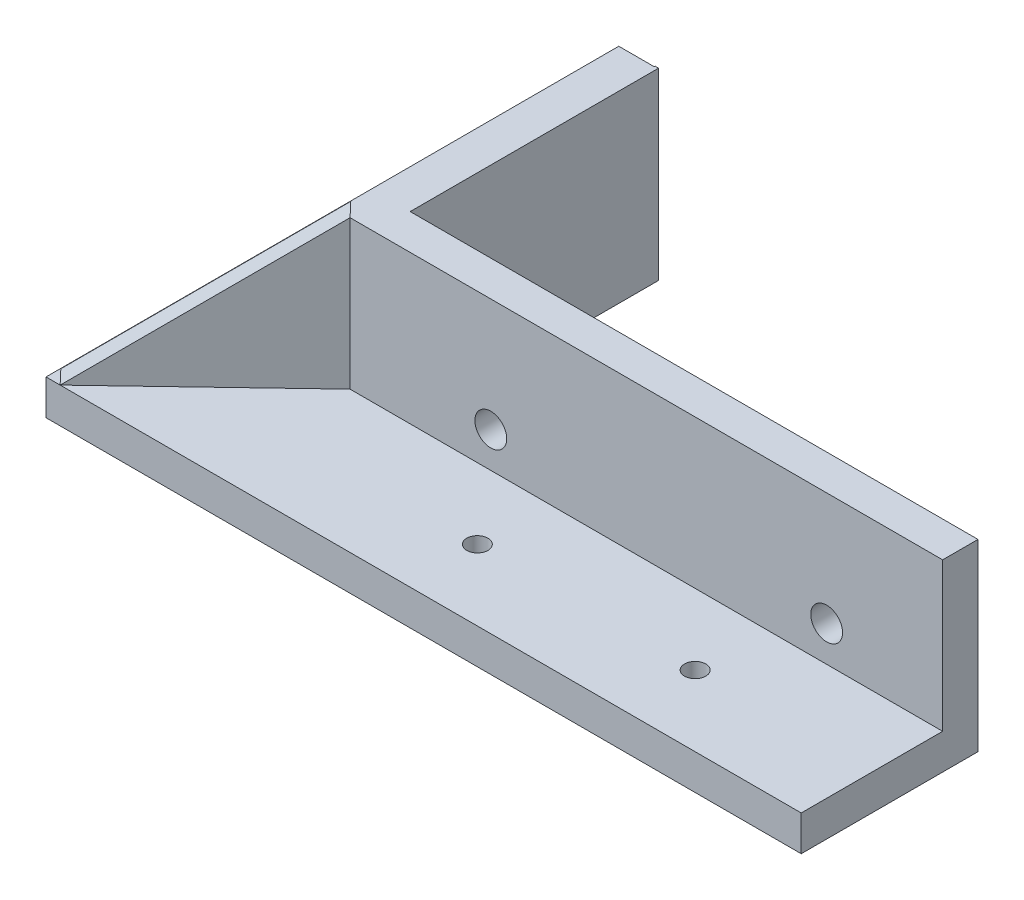
ISO-10303-21;
HEADER;
FILE_DESCRIPTION(('STEP AP214'),'2;1');
FILE_NAME('part.step','',(''),(''),'','','');
FILE_SCHEMA(('AUTOMOTIVE_DESIGN { 1 0 10303 214 1 1 1 1 }'));
ENDSEC;
DATA;
#1=APPLICATION_CONTEXT('core data for automotive mechanical design processes');
#2=APPLICATION_PROTOCOL_DEFINITION('international standard','automotive_design',2000,#1);
#3=PRODUCT_CONTEXT('',#1,'mechanical');
#4=PRODUCT('Part','Part','',(#3));
#5=PRODUCT_RELATED_PRODUCT_CATEGORY('part','',(#4));
#6=PRODUCT_DEFINITION_FORMATION('','',#4);
#7=PRODUCT_DEFINITION_CONTEXT('part definition',#1,'design');
#8=PRODUCT_DEFINITION('design','',#6,#7);
#9=PRODUCT_DEFINITION_SHAPE('','',#8);
#10=(LENGTH_UNIT() NAMED_UNIT(*) SI_UNIT(.MILLI.,.METRE.));
#11=(NAMED_UNIT(*) PLANE_ANGLE_UNIT() SI_UNIT($,.RADIAN.));
#12=(NAMED_UNIT(*) SI_UNIT($,.STERADIAN.) SOLID_ANGLE_UNIT());
#13=UNCERTAINTY_MEASURE_WITH_UNIT(LENGTH_MEASURE(1.E-05),#10,'distance_accuracy_value','');
#14=(GEOMETRIC_REPRESENTATION_CONTEXT(3) GLOBAL_UNCERTAINTY_ASSIGNED_CONTEXT((#13)) GLOBAL_UNIT_ASSIGNED_CONTEXT((#10,
#11,#12)) REPRESENTATION_CONTEXT('',''));
#15=CARTESIAN_POINT('',(0.,0.,0.));
#16=DIRECTION('',(0.,0.,1.));
#17=DIRECTION('',(1.,0.,0.));
#18=AXIS2_PLACEMENT_3D('',#15,#16,#17);
#19=CARTESIAN_POINT('',(0.,5.,-2.49999999999999));
#20=DIRECTION('',(0.,0.,-1.));
#21=DIRECTION('',(-1.,0.,0.));
#22=AXIS2_PLACEMENT_3D('',#19,#20,#21);
#23=PLANE('',#22);
#24=CARTESIAN_POINT('',(-23.5,10.,-2.5));
#25=DIRECTION('',(0.,0.,-1.));
#26=DIRECTION('',(-1.,0.,0.));
#27=AXIS2_PLACEMENT_3D('',#24,#25,#26);
#28=CIRCLE('',#27,2.25);
#29=CARTESIAN_POINT('',(-25.75,10.,-2.5));
#30=VERTEX_POINT('',#29);
#31=EDGE_CURVE('E212',#30,#30,#28,.T.);
#32=ORIENTED_EDGE('',*,*,#31,.F.);
#33=EDGE_LOOP('',(#32));
#34=FACE_BOUND('',#33,.T.);
#35=CARTESIAN_POINT('',(24.,10.,-2.5));
#36=DIRECTION('',(0.,0.,-1.));
#37=DIRECTION('',(-1.,0.,0.));
#38=AXIS2_PLACEMENT_3D('',#35,#36,#37);
#39=CIRCLE('',#38,2.25);
#40=CARTESIAN_POINT('',(21.75,10.,-2.5));
#41=VERTEX_POINT('',#40);
#42=EDGE_CURVE('E207',#41,#41,#39,.T.);
#43=ORIENTED_EDGE('',*,*,#42,.F.);
#44=EDGE_LOOP('',(#43));
#45=FACE_BOUND('',#44,.T.);
#46=DIRECTION('',(1.,0.,0.));
#47=VECTOR('',#46,1.);
#48=CARTESIAN_POINT('',(0.,0.,-2.49999999999999));
#49=LINE('',#48,#47);
#50=CARTESIAN_POINT('',(-39.9,0.,-2.5));
#51=VERTEX_POINT('',#50);
#52=CARTESIAN_POINT('',(40.4,0.,-2.49999999999998));
#53=VERTEX_POINT('',#52);
#54=EDGE_CURVE('E266',#51,#53,#49,.T.);
#55=ORIENTED_EDGE('',*,*,#54,.F.);
#56=DIRECTION('',(0.,1.,0.));
#57=VECTOR('',#56,1.);
#58=CARTESIAN_POINT('',(-39.9,5.,-2.49999999999999));
#59=LINE('',#58,#57);
#60=CARTESIAN_POINT('',(-39.9,26.,-2.5));
#61=VERTEX_POINT('',#60);
#62=EDGE_CURVE('E142',#51,#61,#59,.T.);
#63=ORIENTED_EDGE('',*,*,#62,.T.);
#64=DIRECTION('',(1.,0.,0.));
#65=VECTOR('',#64,1.);
#66=CARTESIAN_POINT('',(0.,26.,-2.49999999999999));
#67=LINE('',#66,#65);
#68=CARTESIAN_POINT('',(40.4,26.,-2.49999999999999));
#69=VERTEX_POINT('',#68);
#70=EDGE_CURVE('E250',#61,#69,#67,.T.);
#71=ORIENTED_EDGE('',*,*,#70,.T.);
#72=DIRECTION('',(0.,-1.,0.));
#73=VECTOR('',#72,1.);
#74=CARTESIAN_POINT('',(40.4,5.,-2.49999999999999));
#75=LINE('',#74,#73);
#76=EDGE_CURVE('E11',#69,#53,#75,.T.);
#77=ORIENTED_EDGE('',*,*,#76,.T.);
#78=EDGE_LOOP('',(#55,#63,#71,#77));
#79=FACE_BOUND('',#78,.T.);
#80=ADVANCED_FACE('F37',(#34,#45,#79),#23,.T.);
#81=CARTESIAN_POINT('',(0.,5.,22.5));
#82=DIRECTION('',(0.,0.,-1.));
#83=DIRECTION('',(-1.,0.,0.));
#84=AXIS2_PLACEMENT_3D('',#81,#82,#83);
#85=PLANE('',#84);
#86=DIRECTION('',(1.,0.,0.));
#87=VECTOR('',#86,1.);
#88=CARTESIAN_POINT('',(0.,0.,22.5));
#89=LINE('',#88,#87);
#90=CARTESIAN_POINT('',(-66.4,0.,22.5));
#91=VERTEX_POINT('',#90);
#92=CARTESIAN_POINT('',(40.4,0.,22.5));
#93=VERTEX_POINT('',#92);
#94=EDGE_CURVE('E254',#91,#93,#89,.T.);
#95=ORIENTED_EDGE('',*,*,#94,.T.);
#96=DIRECTION('',(0.,1.,0.));
#97=VECTOR('',#96,1.);
#98=CARTESIAN_POINT('',(40.4,5.,22.5));
#99=LINE('',#98,#97);
#100=CARTESIAN_POINT('',(40.4,5.,22.5));
#101=VERTEX_POINT('',#100);
#102=EDGE_CURVE('E52',#93,#101,#99,.T.);
#103=ORIENTED_EDGE('',*,*,#102,.T.);
#104=DIRECTION('',(1.,0.,0.));
#105=VECTOR('',#104,1.);
#106=CARTESIAN_POINT('',(0.,5.,22.5));
#107=LINE('',#106,#105);
#108=CARTESIAN_POINT('',(-64.4,5.,22.5));
#109=VERTEX_POINT('',#108);
#110=EDGE_CURVE('E255',#109,#101,#107,.T.);
#111=ORIENTED_EDGE('',*,*,#110,.F.);
#112=DIRECTION('',(-1.,0.,0.));
#113=VECTOR('',#112,1.);
#114=CARTESIAN_POINT('',(0.,5.,22.5));
#115=LINE('',#114,#113);
#116=CARTESIAN_POINT('',(-66.4,5.,22.5));
#117=VERTEX_POINT('',#116);
#118=EDGE_CURVE('E189',#109,#117,#115,.T.);
#119=ORIENTED_EDGE('',*,*,#118,.T.);
#120=DIRECTION('',(0.,-1.,0.));
#121=VECTOR('',#120,1.);
#122=CARTESIAN_POINT('',(-66.4,5.,22.5));
#123=LINE('',#122,#121);
#124=EDGE_CURVE('E233',#117,#91,#123,.T.);
#125=ORIENTED_EDGE('',*,*,#124,.T.);
#126=EDGE_LOOP('',(#95,#103,#111,#119,#125));
#127=FACE_BOUND('',#126,.T.);
#128=ADVANCED_FACE('F39',(#127),#85,.F.);
#129=CARTESIAN_POINT('',(0.,26.,0.));
#130=DIRECTION('',(0.,1.,0.));
#131=DIRECTION('',(0.,0.,1.));
#132=AXIS2_PLACEMENT_3D('',#129,#130,#131);
#133=PLANE('',#132);
#134=ORIENTED_EDGE('',*,*,#70,.F.);
#135=DIRECTION('',(0.,0.,1.));
#136=VECTOR('',#135,1.);
#137=CARTESIAN_POINT('',(-39.9,26.,-37.6291713866203));
#138=LINE('',#137,#136);
#139=CARTESIAN_POINT('',(-39.9,26.,-37.6291713866203));
#140=VERTEX_POINT('',#139);
#141=EDGE_CURVE('E155',#140,#61,#138,.T.);
#142=ORIENTED_EDGE('',*,*,#141,.F.);
#143=DIRECTION('',(-1.,0.,0.));
#144=VECTOR('',#143,1.);
#145=CARTESIAN_POINT('',(-39.9,26.,-37.6291713866203));
#146=LINE('',#145,#144);
#147=CARTESIAN_POINT('',(-40.4,26.,-37.6291713866203));
#148=VERTEX_POINT('',#147);
#149=EDGE_CURVE('E153',#140,#148,#146,.T.);
#150=ORIENTED_EDGE('',*,*,#149,.T.);
#151=DIRECTION('',(0.,0.,1.));
#152=VECTOR('',#151,1.);
#153=CARTESIAN_POINT('',(-40.4,26.,-37.6291713866203));
#154=LINE('',#153,#152);
#155=CARTESIAN_POINT('',(-40.4,26.,-37.5));
#156=VERTEX_POINT('',#155);
#157=EDGE_CURVE('E146',#148,#156,#154,.T.);
#158=ORIENTED_EDGE('',*,*,#157,.T.);
#159=DIRECTION('',(-1.,0.,0.));
#160=VECTOR('',#159,1.);
#161=CARTESIAN_POINT('',(0.,26.,-37.5));
#162=LINE('',#161,#160);
#163=CARTESIAN_POINT('',(-45.4,26.,-37.5));
#164=VERTEX_POINT('',#163);
#165=EDGE_CURVE('E215',#156,#164,#162,.T.);
#166=ORIENTED_EDGE('',*,*,#165,.T.);
#167=DIRECTION('',(0.,0.,1.));
#168=VECTOR('',#167,1.);
#169=CARTESIAN_POINT('',(-45.4,26.,0.));
#170=LINE('',#169,#168);
#171=CARTESIAN_POINT('',(-45.4,26.,0.400000000000003));
#172=VERTEX_POINT('',#171);
#173=EDGE_CURVE('E217',#164,#172,#170,.T.);
#174=ORIENTED_EDGE('',*,*,#173,.T.);
#175=DIRECTION('',(-0.689655172413793,0.,-0.724137931034483));
#176=VECTOR('',#175,1.);
#177=CARTESIAN_POINT('',(-24.0064209274673,26.,22.8632580261593));
#178=LINE('',#177,#176);
#179=CARTESIAN_POINT('',(-43.4,26.,2.50000000000001));
#180=VERTEX_POINT('',#179);
#181=EDGE_CURVE('E187',#180,#172,#178,.T.);
#182=ORIENTED_EDGE('',*,*,#181,.F.);
#183=DIRECTION('',(1.,0.,0.));
#184=VECTOR('',#183,1.);
#185=CARTESIAN_POINT('',(0.,26.,2.5));
#186=LINE('',#185,#184);
#187=CARTESIAN_POINT('',(40.4,26.,2.50000000000001));
#188=VERTEX_POINT('',#187);
#189=EDGE_CURVE('E247',#180,#188,#186,.T.);
#190=ORIENTED_EDGE('',*,*,#189,.T.);
#191=DIRECTION('',(0.,0.,1.));
#192=VECTOR('',#191,1.);
#193=CARTESIAN_POINT('',(40.4,26.,0.));
#194=LINE('',#193,#192);
#195=EDGE_CURVE('E169',#69,#188,#194,.T.);
#196=ORIENTED_EDGE('',*,*,#195,.F.);
#197=EDGE_LOOP('',(#134,#142,#150,#158,#166,#174,#182,#190,#196));
#198=FACE_BOUND('',#197,.T.);
#199=ADVANCED_FACE('F294',(#198),#133,.T.);
#200=CARTESIAN_POINT('',(0.,5.,0.));
#201=DIRECTION('',(0.,1.,0.));
#202=DIRECTION('',(0.,0.,1.));
#203=AXIS2_PLACEMENT_3D('',#200,#201,#202);
#204=PLANE('',#203);
#205=DIRECTION('',(0.,0.,1.));
#206=VECTOR('',#205,1.);
#207=CARTESIAN_POINT('',(-66.4,5.,0.));
#208=LINE('',#207,#206);
#209=CARTESIAN_POINT('',(-66.4,5.,-37.5));
#210=VERTEX_POINT('',#209);
#211=EDGE_CURVE('E227',#210,#117,#208,.T.);
#212=ORIENTED_EDGE('',*,*,#211,.T.);
#213=ORIENTED_EDGE('',*,*,#118,.F.);
#214=DIRECTION('',(0.689655172413793,0.,0.724137931034483));
#215=VECTOR('',#214,1.);
#216=CARTESIAN_POINT('',(-78.8827586206896,5.,7.29310344827587));
#217=LINE('',#216,#215);
#218=CARTESIAN_POINT('',(-66.3500594530321,4.99999999999999,20.4524375743163));
#219=VERTEX_POINT('',#218);
#220=EDGE_CURVE('E179',#219,#109,#217,.T.);
#221=ORIENTED_EDGE('',*,*,#220,.F.);
#222=DIRECTION('',(-0.724137931034483,0.,0.689655172413793));
#223=VECTOR('',#222,1.);
#224=CARTESIAN_POINT('',(-66.4,5.,20.5));
#225=LINE('',#224,#223);
#226=CARTESIAN_POINT('',(-45.4,5.,0.500000000000007));
#227=VERTEX_POINT('',#226);
#228=EDGE_CURVE('E192',#227,#219,#225,.T.);
#229=ORIENTED_EDGE('',*,*,#228,.F.);
#230=DIRECTION('',(0.,0.,-1.));
#231=VECTOR('',#230,1.);
#232=CARTESIAN_POINT('',(-45.4,5.,0.));
#233=LINE('',#232,#231);
#234=CARTESIAN_POINT('',(-45.4,5.,-37.5));
#235=VERTEX_POINT('',#234);
#236=EDGE_CURVE('E60',#227,#235,#233,.T.);
#237=ORIENTED_EDGE('',*,*,#236,.T.);
#238=DIRECTION('',(-1.,0.,0.));
#239=VECTOR('',#238,1.);
#240=CARTESIAN_POINT('',(0.,5.,-37.5));
#241=LINE('',#240,#239);
#242=EDGE_CURVE('E225',#235,#210,#241,.T.);
#243=ORIENTED_EDGE('',*,*,#242,.T.);
#244=EDGE_LOOP('',(#212,#213,#221,#229,#237,#243));
#245=FACE_BOUND('',#244,.T.);
#246=CARTESIAN_POINT('',(-55.4,5.,-12.5));
#247=DIRECTION('',(0.,1.,0.));
#248=DIRECTION('',(0.,0.,1.));
#249=AXIS2_PLACEMENT_3D('',#246,#247,#248);
#250=CIRCLE('',#249,1.5);
#251=CARTESIAN_POINT('',(-55.4,5.,-11.));
#252=VERTEX_POINT('',#251);
#253=EDGE_CURVE('E230',#252,#252,#250,.T.);
#254=ORIENTED_EDGE('',*,*,#253,.F.);
#255=EDGE_LOOP('',(#254));
#256=FACE_BOUND('',#255,.T.);
#257=ADVANCED_FACE('F315',(#245,#256),#204,.T.);
#258=DIRECTION('',(0.,0.,1.));
#259=VECTOR('',#258,1.);
#260=CARTESIAN_POINT('',(40.4,5.,0.));
#261=LINE('',#260,#259);
#262=CARTESIAN_POINT('',(40.4,5.,2.49999999999999));
#263=VERTEX_POINT('',#262);
#264=EDGE_CURVE('E174',#263,#101,#261,.T.);
#265=ORIENTED_EDGE('',*,*,#264,.F.);
#266=DIRECTION('',(-1.,0.,0.));
#267=VECTOR('',#266,1.);
#268=CARTESIAN_POINT('',(0.,5.,2.5));
#269=LINE('',#268,#267);
#270=CARTESIAN_POINT('',(-43.4,5.,2.50000000000001));
#271=VERTEX_POINT('',#270);
#272=EDGE_CURVE('E252',#263,#271,#269,.T.);
#273=ORIENTED_EDGE('',*,*,#272,.T.);
#274=DIRECTION('',(0.724137931034483,0.,-0.689655172413793));
#275=VECTOR('',#274,1.);
#276=CARTESIAN_POINT('',(-43.4,5.,2.50000000000001));
#277=LINE('',#276,#275);
#278=EDGE_CURVE('E195',#109,#271,#277,.T.);
#279=ORIENTED_EDGE('',*,*,#278,.F.);
#280=ORIENTED_EDGE('',*,*,#110,.T.);
#281=EDGE_LOOP('',(#265,#273,#279,#280));
#282=FACE_BOUND('',#281,.T.);
#283=CARTESIAN_POINT('',(15.4,5.,12.5));
#284=DIRECTION('',(0.,1.,0.));
#285=DIRECTION('',(0.,0.,1.));
#286=AXIS2_PLACEMENT_3D('',#283,#284,#285);
#287=CIRCLE('',#286,1.5);
#288=CARTESIAN_POINT('',(15.4,5.,14.));
#289=VERTEX_POINT('',#288);
#290=EDGE_CURVE('E45',#289,#289,#287,.F.);
#291=ORIENTED_EDGE('',*,*,#290,.T.);
#292=EDGE_LOOP('',(#291));
#293=FACE_BOUND('',#292,.T.);
#294=CARTESIAN_POINT('',(-15.4,5.,12.5));
#295=DIRECTION('',(0.,1.,0.));
#296=DIRECTION('',(0.,0.,1.));
#297=AXIS2_PLACEMENT_3D('',#294,#295,#296);
#298=CIRCLE('',#297,1.5);
#299=CARTESIAN_POINT('',(-15.4,5.,14.));
#300=VERTEX_POINT('',#299);
#301=EDGE_CURVE('E258',#300,#300,#298,.T.);
#302=ORIENTED_EDGE('',*,*,#301,.F.);
#303=EDGE_LOOP('',(#302));
#304=FACE_BOUND('',#303,.T.);
#305=ADVANCED_FACE('F313',(#282,#293,#304),#204,.T.);
#306=CARTESIAN_POINT('',(0.,26.,2.5));
#307=DIRECTION('',(0.,0.,-1.));
#308=DIRECTION('',(-1.,0.,0.));
#309=AXIS2_PLACEMENT_3D('',#306,#307,#308);
#310=PLANE('',#309);
#311=CARTESIAN_POINT('',(24.,10.,2.5));
#312=DIRECTION('',(0.,0.,1.));
#313=DIRECTION('',(1.,0.,0.));
#314=AXIS2_PLACEMENT_3D('',#311,#312,#313);
#315=CIRCLE('',#314,2.25);
#316=CARTESIAN_POINT('',(26.25,10.,2.5));
#317=VERTEX_POINT('',#316);
#318=EDGE_CURVE('E203',#317,#317,#315,.T.);
#319=ORIENTED_EDGE('',*,*,#318,.F.);
#320=EDGE_LOOP('',(#319));
#321=FACE_BOUND('',#320,.T.);
#322=CARTESIAN_POINT('',(-23.5,10.,2.5));
#323=DIRECTION('',(0.,0.,1.));
#324=DIRECTION('',(1.,0.,0.));
#325=AXIS2_PLACEMENT_3D('',#322,#323,#324);
#326=CIRCLE('',#325,2.25);
#327=CARTESIAN_POINT('',(-21.25,10.,2.5));
#328=VERTEX_POINT('',#327);
#329=EDGE_CURVE('E204',#328,#328,#326,.T.);
#330=ORIENTED_EDGE('',*,*,#329,.F.);
#331=EDGE_LOOP('',(#330));
#332=FACE_BOUND('',#331,.T.);
#333=ORIENTED_EDGE('',*,*,#272,.F.);
#334=DIRECTION('',(0.,1.,0.));
#335=VECTOR('',#334,1.);
#336=CARTESIAN_POINT('',(40.4,26.,2.49999999999999));
#337=LINE('',#336,#335);
#338=EDGE_CURVE('E171',#263,#188,#337,.T.);
#339=ORIENTED_EDGE('',*,*,#338,.T.);
#340=ORIENTED_EDGE('',*,*,#189,.F.);
#341=DIRECTION('',(0.,-1.,0.));
#342=VECTOR('',#341,1.);
#343=CARTESIAN_POINT('',(-43.4,26.,2.50000000000001));
#344=LINE('',#343,#342);
#345=EDGE_CURVE('E200',#180,#271,#344,.T.);
#346=ORIENTED_EDGE('',*,*,#345,.T.);
#347=EDGE_LOOP('',(#333,#339,#340,#346));
#348=FACE_BOUND('',#347,.T.);
#349=ADVANCED_FACE('F305',(#321,#332,#348),#310,.F.);
#350=CARTESIAN_POINT('',(-45.4,26.,0.));
#351=DIRECTION('',(1.,0.,0.));
#352=DIRECTION('',(0.,0.,-1.));
#353=AXIS2_PLACEMENT_3D('',#350,#351,#352);
#354=PLANE('',#353);
#355=DIRECTION('',(0.,-1.,0.));
#356=VECTOR('',#355,1.);
#357=CARTESIAN_POINT('',(-45.4,26.,0.500000000000007));
#358=LINE('',#357,#356);
#359=CARTESIAN_POINT('',(-45.4,25.9500594530321,0.500000000000007));
#360=VERTEX_POINT('',#359);
#361=EDGE_CURVE('E198',#360,#227,#358,.T.);
#362=ORIENTED_EDGE('',*,*,#361,.F.);
#363=DIRECTION('',(0.,0.446788032480034,-0.894639845989781));
#364=VECTOR('',#363,1.);
#365=CARTESIAN_POINT('',(-45.4,26.1598857506272,0.0798478183869536));
#366=LINE('',#365,#364);
#367=EDGE_CURVE('E184',#360,#172,#366,.T.);
#368=ORIENTED_EDGE('',*,*,#367,.T.);
#369=ORIENTED_EDGE('',*,*,#173,.F.);
#370=DIRECTION('',(0.,-1.,0.));
#371=VECTOR('',#370,1.);
#372=CARTESIAN_POINT('',(-45.4,26.,-37.5));
#373=LINE('',#372,#371);
#374=EDGE_CURVE('E220',#164,#235,#373,.T.);
#375=ORIENTED_EDGE('',*,*,#374,.T.);
#376=ORIENTED_EDGE('',*,*,#236,.F.);
#377=EDGE_LOOP('',(#362,#368,#369,#375,#376));
#378=FACE_BOUND('',#377,.T.);
#379=ADVANCED_FACE('F300',(#378),#354,.F.);
#380=CARTESIAN_POINT('',(-15.4,5.,12.5));
#381=DIRECTION('',(0.,-1.,0.));
#382=DIRECTION('',(0.,0.,-1.));
#383=AXIS2_PLACEMENT_3D('',#380,#381,#382);
#384=CYLINDRICAL_SURFACE('',#383,1.5);
#385=ORIENTED_EDGE('',*,*,#301,.T.);
#386=EDGE_LOOP('',(#385));
#387=FACE_BOUND('',#386,.T.);
#388=CARTESIAN_POINT('',(-15.4,0.,12.5));
#389=DIRECTION('',(0.,1.,0.));
#390=DIRECTION('',(0.,0.,1.));
#391=AXIS2_PLACEMENT_3D('',#388,#389,#390);
#392=CIRCLE('',#391,1.5);
#393=CARTESIAN_POINT('',(-15.4,0.,14.));
#394=VERTEX_POINT('',#393);
#395=EDGE_CURVE('E268',#394,#394,#392,.T.);
#396=ORIENTED_EDGE('',*,*,#395,.F.);
#397=EDGE_LOOP('',(#396));
#398=FACE_BOUND('',#397,.T.);
#399=ADVANCED_FACE('F285',(#387,#398),#384,.F.);
#400=CARTESIAN_POINT('',(15.4,5.,12.5));
#401=DIRECTION('',(0.,-1.,0.));
#402=DIRECTION('',(0.,0.,-1.));
#403=AXIS2_PLACEMENT_3D('',#400,#401,#402);
#404=CYLINDRICAL_SURFACE('',#403,1.5);
#405=ORIENTED_EDGE('',*,*,#290,.F.);
#406=EDGE_LOOP('',(#405));
#407=FACE_BOUND('',#406,.T.);
#408=CARTESIAN_POINT('',(15.4,0.,12.5));
#409=DIRECTION('',(0.,1.,0.));
#410=DIRECTION('',(0.,0.,1.));
#411=AXIS2_PLACEMENT_3D('',#408,#409,#410);
#412=CIRCLE('',#411,1.5);
#413=CARTESIAN_POINT('',(15.4,0.,14.));
#414=VERTEX_POINT('',#413);
#415=EDGE_CURVE('E259',#414,#414,#412,.F.);
#416=ORIENTED_EDGE('',*,*,#415,.T.);
#417=EDGE_LOOP('',(#416));
#418=FACE_BOUND('',#417,.T.);
#419=ADVANCED_FACE('F273',(#407,#418),#404,.F.);
#420=CARTESIAN_POINT('',(0.,0.,0.));
#421=DIRECTION('',(0.,1.,0.));
#422=DIRECTION('',(0.,0.,1.));
#423=AXIS2_PLACEMENT_3D('',#420,#421,#422);
#424=PLANE('',#423);
#425=DIRECTION('',(0.,0.,-1.));
#426=VECTOR('',#425,1.);
#427=CARTESIAN_POINT('',(-39.9,0.,-37.6291713866203));
#428=LINE('',#427,#426);
#429=CARTESIAN_POINT('',(-39.9,0.,-37.6291713866203));
#430=VERTEX_POINT('',#429);
#431=EDGE_CURVE('E136',#51,#430,#428,.T.);
#432=ORIENTED_EDGE('',*,*,#431,.F.);
#433=ORIENTED_EDGE('',*,*,#54,.T.);
#434=DIRECTION('',(0.,0.,-1.));
#435=VECTOR('',#434,1.);
#436=CARTESIAN_POINT('',(40.4,0.,52.5));
#437=LINE('',#436,#435);
#438=EDGE_CURVE('E163',#93,#53,#437,.T.);
#439=ORIENTED_EDGE('',*,*,#438,.F.);
#440=ORIENTED_EDGE('',*,*,#94,.F.);
#441=DIRECTION('',(0.,0.,1.));
#442=VECTOR('',#441,1.);
#443=CARTESIAN_POINT('',(-66.4,0.,0.));
#444=LINE('',#443,#442);
#445=CARTESIAN_POINT('',(-66.4,0.,-37.5));
#446=VERTEX_POINT('',#445);
#447=EDGE_CURVE('E235',#446,#91,#444,.T.);
#448=ORIENTED_EDGE('',*,*,#447,.F.);
#449=DIRECTION('',(-1.,0.,0.));
#450=VECTOR('',#449,1.);
#451=CARTESIAN_POINT('',(0.,0.,-37.5));
#452=LINE('',#451,#450);
#453=CARTESIAN_POINT('',(-40.4,0.,-37.5));
#454=VERTEX_POINT('',#453);
#455=EDGE_CURVE('E224',#454,#446,#452,.T.);
#456=ORIENTED_EDGE('',*,*,#455,.F.);
#457=DIRECTION('',(0.,0.,-1.));
#458=VECTOR('',#457,1.);
#459=CARTESIAN_POINT('',(-40.4,0.,-37.6291713866203));
#460=LINE('',#459,#458);
#461=CARTESIAN_POINT('',(-40.4,0.,-37.6291713866203));
#462=VERTEX_POINT('',#461);
#463=EDGE_CURVE('E160',#454,#462,#460,.T.);
#464=ORIENTED_EDGE('',*,*,#463,.T.);
#465=DIRECTION('',(-1.,0.,0.));
#466=VECTOR('',#465,1.);
#467=CARTESIAN_POINT('',(-39.9,0.,-37.6291713866203));
#468=LINE('',#467,#466);
#469=EDGE_CURVE('E151',#430,#462,#468,.T.);
#470=ORIENTED_EDGE('',*,*,#469,.F.);
#471=EDGE_LOOP('',(#432,#433,#439,#440,#448,#456,#464,#470));
#472=FACE_BOUND('',#471,.T.);
#473=CARTESIAN_POINT('',(-55.4,0.,-12.5));
#474=DIRECTION('',(0.,1.,0.));
#475=DIRECTION('',(0.,0.,1.));
#476=AXIS2_PLACEMENT_3D('',#473,#474,#475);
#477=CIRCLE('',#476,1.5);
#478=CARTESIAN_POINT('',(-55.4,0.,-11.));
#479=VERTEX_POINT('',#478);
#480=EDGE_CURVE('E228',#479,#479,#477,.T.);
#481=ORIENTED_EDGE('',*,*,#480,.T.);
#482=EDGE_LOOP('',(#481));
#483=FACE_BOUND('',#482,.T.);
#484=ORIENTED_EDGE('',*,*,#395,.T.);
#485=EDGE_LOOP('',(#484));
#486=FACE_BOUND('',#485,.T.);
#487=ORIENTED_EDGE('',*,*,#415,.F.);
#488=EDGE_LOOP('',(#487));
#489=FACE_BOUND('',#488,.T.);
#490=ADVANCED_FACE('F157',(#472,#483,#486,#489),#424,.F.);
#491=CARTESIAN_POINT('',(0.,5.,-37.5));
#492=DIRECTION('',(0.,0.,1.));
#493=DIRECTION('',(1.,0.,0.));
#494=AXIS2_PLACEMENT_3D('',#491,#492,#493);
#495=PLANE('',#494);
#496=ORIENTED_EDGE('',*,*,#455,.T.);
#497=DIRECTION('',(0.,-1.,0.));
#498=VECTOR('',#497,1.);
#499=CARTESIAN_POINT('',(-66.4,5.,-37.5));
#500=LINE('',#499,#498);
#501=EDGE_CURVE('E241',#210,#446,#500,.T.);
#502=ORIENTED_EDGE('',*,*,#501,.F.);
#503=ORIENTED_EDGE('',*,*,#242,.F.);
#504=ORIENTED_EDGE('',*,*,#374,.F.);
#505=ORIENTED_EDGE('',*,*,#165,.F.);
#506=DIRECTION('',(0.,-1.,0.));
#507=VECTOR('',#506,1.);
#508=CARTESIAN_POINT('',(-40.4,5.,-37.5));
#509=LINE('',#508,#507);
#510=EDGE_CURVE('E244',#156,#454,#509,.T.);
#511=ORIENTED_EDGE('',*,*,#510,.T.);
#512=EDGE_LOOP('',(#496,#502,#503,#504,#505,#511));
#513=FACE_BOUND('',#512,.T.);
#514=ADVANCED_FACE('F276',(#513),#495,.F.);
#515=CARTESIAN_POINT('',(-66.4,5.,0.));
#516=DIRECTION('',(1.,0.,0.));
#517=DIRECTION('',(0.,0.,-1.));
#518=AXIS2_PLACEMENT_3D('',#515,#516,#517);
#519=PLANE('',#518);
#520=ORIENTED_EDGE('',*,*,#124,.F.);
#521=ORIENTED_EDGE('',*,*,#211,.F.);
#522=ORIENTED_EDGE('',*,*,#501,.T.);
#523=ORIENTED_EDGE('',*,*,#447,.T.);
#524=EDGE_LOOP('',(#520,#521,#522,#523));
#525=FACE_BOUND('',#524,.T.);
#526=ADVANCED_FACE('F282',(#525),#519,.F.);
#527=CARTESIAN_POINT('',(-55.4,5.,-12.5));
#528=DIRECTION('',(0.,-1.,0.));
#529=DIRECTION('',(0.,0.,-1.));
#530=AXIS2_PLACEMENT_3D('',#527,#528,#529);
#531=CYLINDRICAL_SURFACE('',#530,1.5);
#532=ORIENTED_EDGE('',*,*,#253,.T.);
#533=EDGE_LOOP('',(#532));
#534=FACE_BOUND('',#533,.T.);
#535=ORIENTED_EDGE('',*,*,#480,.F.);
#536=EDGE_LOOP('',(#535));
#537=FACE_BOUND('',#536,.T.);
#538=ADVANCED_FACE('F331',(#534,#537),#531,.F.);
#539=CARTESIAN_POINT('',(24.,10.,-23.5));
#540=DIRECTION('',(0.,0.,1.));
#541=DIRECTION('',(1.,0.,0.));
#542=AXIS2_PLACEMENT_3D('',#539,#540,#541);
#543=CYLINDRICAL_SURFACE('',#542,2.25);
#544=ORIENTED_EDGE('',*,*,#42,.T.);
#545=EDGE_LOOP('',(#544));
#546=FACE_BOUND('',#545,.T.);
#547=ORIENTED_EDGE('',*,*,#318,.T.);
#548=EDGE_LOOP('',(#547));
#549=FACE_BOUND('',#548,.T.);
#550=ADVANCED_FACE('F334',(#546,#549),#543,.F.);
#551=CARTESIAN_POINT('',(-23.5,10.,-23.5));
#552=DIRECTION('',(0.,0.,1.));
#553=DIRECTION('',(1.,0.,0.));
#554=AXIS2_PLACEMENT_3D('',#551,#552,#553);
#555=CYLINDRICAL_SURFACE('',#554,2.25);
#556=ORIENTED_EDGE('',*,*,#31,.T.);
#557=EDGE_LOOP('',(#556));
#558=FACE_BOUND('',#557,.T.);
#559=ORIENTED_EDGE('',*,*,#329,.T.);
#560=EDGE_LOOP('',(#559));
#561=FACE_BOUND('',#560,.T.);
#562=ADVANCED_FACE('F339',(#558,#561),#555,.F.);
#563=CARTESIAN_POINT('',(-66.4,26.,20.5));
#564=DIRECTION('',(0.689655172413793,0.,0.724137931034483));
#565=DIRECTION('',(0.724137931034483,0.,-0.689655172413793));
#566=AXIS2_PLACEMENT_3D('',#563,#564,#565);
#567=PLANE('',#566);
#568=ORIENTED_EDGE('',*,*,#228,.T.);
#569=DIRECTION('',(0.586509812151843,0.586509812151844,-0.558580773477945));
#570=VECTOR('',#569,1.);
#571=CARTESIAN_POINT('',(-59.1589518087263,12.1911076443058,13.6037636273584));
#572=LINE('',#571,#570);
#573=EDGE_CURVE('E181',#219,#360,#572,.T.);
#574=ORIENTED_EDGE('',*,*,#573,.T.);
#575=ORIENTED_EDGE('',*,*,#361,.T.);
#576=EDGE_LOOP('',(#568,#574,#575));
#577=FACE_BOUND('',#576,.T.);
#578=ADVANCED_FACE('F343',(#577),#567,.F.);
#579=CARTESIAN_POINT('',(-43.4,26.,2.50000000000001));
#580=DIRECTION('',(-0.689655172413793,0.,-0.724137931034483));
#581=DIRECTION('',(-0.724137931034483,0.,0.689655172413793));
#582=AXIS2_PLACEMENT_3D('',#579,#580,#581);
#583=PLANE('',#582);
#584=ORIENTED_EDGE('',*,*,#345,.F.);
#585=DIRECTION('',(0.586509812151843,0.586509812151844,-0.558580773477945));
#586=VECTOR('',#585,1.);
#587=CARTESIAN_POINT('',(-43.4,26.,2.50000000000001));
#588=LINE('',#587,#586);
#589=EDGE_CURVE('E177',#109,#180,#588,.T.);
#590=ORIENTED_EDGE('',*,*,#589,.F.);
#591=ORIENTED_EDGE('',*,*,#278,.T.);
#592=EDGE_LOOP('',(#584,#590,#591));
#593=FACE_BOUND('',#592,.T.);
#594=ADVANCED_FACE('F347',(#593),#583,.F.);
#595=CARTESIAN_POINT('',(-57.8827586206896,26.,-12.7068965517241));
#596=DIRECTION('',(0.424714001903059,-0.809942121543021,-0.404489525621961));
#597=DIRECTION('',(0.885625332501467,0.464400441894349,0.));
#598=AXIS2_PLACEMENT_3D('',#595,#596,#597);
#599=PLANE('',#598);
#600=ORIENTED_EDGE('',*,*,#181,.T.);
#601=ORIENTED_EDGE('',*,*,#367,.F.);
#602=ORIENTED_EDGE('',*,*,#573,.F.);
#603=ORIENTED_EDGE('',*,*,#220,.T.);
#604=ORIENTED_EDGE('',*,*,#589,.T.);
#605=EDGE_LOOP('',(#600,#601,#602,#603,#604));
#606=FACE_BOUND('',#605,.T.);
#607=ADVANCED_FACE('F351',(#606),#599,.F.);
#608=CARTESIAN_POINT('',(40.4,0.,52.5));
#609=DIRECTION('',(-1.,0.,0.));
#610=DIRECTION('',(0.,0.,1.));
#611=AXIS2_PLACEMENT_3D('',#608,#609,#610);
#612=PLANE('',#611);
#613=ORIENTED_EDGE('',*,*,#438,.T.);
#614=ORIENTED_EDGE('',*,*,#76,.F.);
#615=ORIENTED_EDGE('',*,*,#195,.T.);
#616=ORIENTED_EDGE('',*,*,#338,.F.);
#617=ORIENTED_EDGE('',*,*,#264,.T.);
#618=ORIENTED_EDGE('',*,*,#102,.F.);
#619=EDGE_LOOP('',(#613,#614,#615,#616,#617,#618));
#620=FACE_BOUND('',#619,.T.);
#621=ADVANCED_FACE('F355',(#620),#612,.F.);
#622=CARTESIAN_POINT('',(-40.4,0.,0.));
#623=DIRECTION('',(-1.,0.,0.));
#624=DIRECTION('',(0.,0.,1.));
#625=AXIS2_PLACEMENT_3D('',#622,#623,#624);
#626=PLANE('',#625);
#627=ORIENTED_EDGE('',*,*,#510,.F.);
#628=ORIENTED_EDGE('',*,*,#157,.F.);
#629=DIRECTION('',(0.,1.,0.));
#630=VECTOR('',#629,1.);
#631=CARTESIAN_POINT('',(-40.4,0.,-37.6291713866203));
#632=LINE('',#631,#630);
#633=EDGE_CURVE('E591',#462,#148,#632,.T.);
#634=ORIENTED_EDGE('',*,*,#633,.F.);
#635=ORIENTED_EDGE('',*,*,#463,.F.);
#636=EDGE_LOOP('',(#627,#628,#634,#635));
#637=FACE_BOUND('',#636,.T.);
#638=ADVANCED_FACE('F359',(#637),#626,.T.);
#639=CARTESIAN_POINT('',(-39.9,0.,-37.6291713866203));
#640=DIRECTION('',(0.,0.,1.));
#641=DIRECTION('',(1.,0.,0.));
#642=AXIS2_PLACEMENT_3D('',#639,#640,#641);
#643=PLANE('',#642);
#644=ORIENTED_EDGE('',*,*,#633,.T.);
#645=ORIENTED_EDGE('',*,*,#149,.F.);
#646=DIRECTION('',(0.,1.,0.));
#647=VECTOR('',#646,1.);
#648=CARTESIAN_POINT('',(-39.9,0.,-37.6291713866203));
#649=LINE('',#648,#647);
#650=EDGE_CURVE('E139',#430,#140,#649,.T.);
#651=ORIENTED_EDGE('',*,*,#650,.F.);
#652=ORIENTED_EDGE('',*,*,#469,.T.);
#653=EDGE_LOOP('',(#644,#645,#651,#652));
#654=FACE_BOUND('',#653,.T.);
#655=ADVANCED_FACE('F150',(#654),#643,.F.);
#656=CARTESIAN_POINT('',(-39.9,0.,0.));
#657=DIRECTION('',(-1.,0.,0.));
#658=DIRECTION('',(0.,0.,1.));
#659=AXIS2_PLACEMENT_3D('',#656,#657,#658);
#660=PLANE('',#659);
#661=ORIENTED_EDGE('',*,*,#62,.F.);
#662=ORIENTED_EDGE('',*,*,#431,.T.);
#663=ORIENTED_EDGE('',*,*,#650,.T.);
#664=ORIENTED_EDGE('',*,*,#141,.T.);
#665=EDGE_LOOP('',(#661,#662,#663,#664));
#666=FACE_BOUND('',#665,.T.);
#667=ADVANCED_FACE('F138',(#666),#660,.F.);
#668=CLOSED_SHELL('',(#80,#128,#199,#257,#305,#349,#379,#399,#419,#490,#514,#526,#538,#550,#562,
#578,#594,#607,#621,#638,#655,#667));
#669=MANIFOLD_SOLID_BREP('B2',#668);
#670=ADVANCED_BREP_SHAPE_REPRESENTATION('',(#18,#669),#14);
#671=SHAPE_DEFINITION_REPRESENTATION(#9,#670);
ENDSEC;
END-ISO-10303-21;
